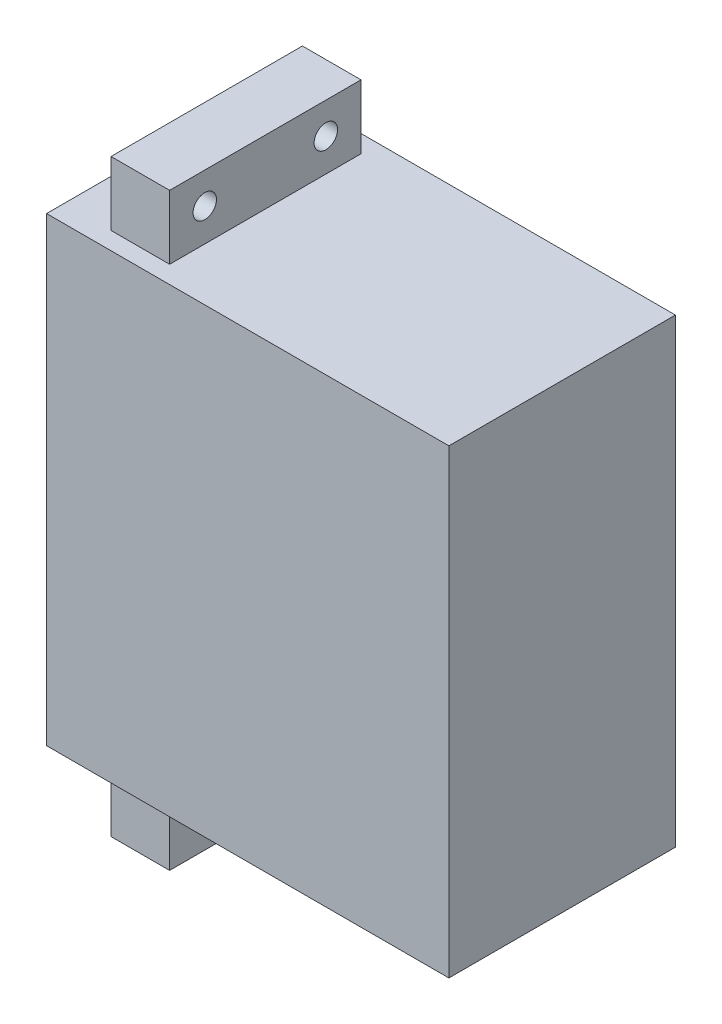
ISO-10303-21;
HEADER;
FILE_DESCRIPTION(('STEP AP214'),'2;1');
FILE_NAME('part.step','',(''),(''),'','','');
FILE_SCHEMA(('AUTOMOTIVE_DESIGN { 1 0 10303 214 1 1 1 1 }'));
ENDSEC;
DATA;
#1=APPLICATION_CONTEXT('core data for automotive mechanical design processes');
#2=APPLICATION_PROTOCOL_DEFINITION('international standard','automotive_design',2000,#1);
#3=PRODUCT_CONTEXT('',#1,'mechanical');
#4=PRODUCT('Part','Part','',(#3));
#5=PRODUCT_RELATED_PRODUCT_CATEGORY('part','',(#4));
#6=PRODUCT_DEFINITION_FORMATION('','',#4);
#7=PRODUCT_DEFINITION_CONTEXT('part definition',#1,'design');
#8=PRODUCT_DEFINITION('design','',#6,#7);
#9=PRODUCT_DEFINITION_SHAPE('','',#8);
#10=(LENGTH_UNIT() NAMED_UNIT(*) SI_UNIT(.MILLI.,.METRE.));
#11=(NAMED_UNIT(*) PLANE_ANGLE_UNIT() SI_UNIT($,.RADIAN.));
#12=(NAMED_UNIT(*) SI_UNIT($,.STERADIAN.) SOLID_ANGLE_UNIT());
#13=UNCERTAINTY_MEASURE_WITH_UNIT(LENGTH_MEASURE(1.E-05),#10,'distance_accuracy_value','');
#14=(GEOMETRIC_REPRESENTATION_CONTEXT(3) GLOBAL_UNCERTAINTY_ASSIGNED_CONTEXT((#13)) GLOBAL_UNIT_ASSIGNED_CONTEXT((#10,
#11,#12)) REPRESENTATION_CONTEXT('',''));
#15=CARTESIAN_POINT('',(0.,0.,0.));
#16=DIRECTION('',(0.,0.,1.));
#17=DIRECTION('',(1.,0.,0.));
#18=AXIS2_PLACEMENT_3D('',#15,#16,#17);
#19=CARTESIAN_POINT('',(0.,59.,29.));
#20=DIRECTION('',(0.,-1.,0.));
#21=DIRECTION('',(0.,0.,-1.));
#22=AXIS2_PLACEMENT_3D('',#19,#20,#21);
#23=PLANE('',#22);
#24=DIRECTION('',(-1.,0.,0.));
#25=VECTOR('',#24,1.);
#26=CARTESIAN_POINT('',(0.,59.,0.));
#27=LINE('',#26,#25);
#28=CARTESIAN_POINT('',(51.5,59.,0.));
#29=VERTEX_POINT('',#28);
#30=CARTESIAN_POINT('',(0.,59.,0.));
#31=VERTEX_POINT('',#30);
#32=EDGE_CURVE('E241',#29,#31,#27,.T.);
#33=ORIENTED_EDGE('',*,*,#32,.T.);
#34=DIRECTION('',(0.,0.,-1.));
#35=VECTOR('',#34,1.);
#36=CARTESIAN_POINT('',(0.,59.,29.));
#37=LINE('',#36,#35);
#38=CARTESIAN_POINT('',(0.,59.,29.));
#39=VERTEX_POINT('',#38);
#40=EDGE_CURVE('E250',#39,#31,#37,.T.);
#41=ORIENTED_EDGE('',*,*,#40,.F.);
#42=DIRECTION('',(-1.,0.,0.));
#43=VECTOR('',#42,1.);
#44=CARTESIAN_POINT('',(0.,59.,29.));
#45=LINE('',#44,#43);
#46=CARTESIAN_POINT('',(51.5,59.,29.));
#47=VERTEX_POINT('',#46);
#48=EDGE_CURVE('E247',#47,#39,#45,.T.);
#49=ORIENTED_EDGE('',*,*,#48,.F.);
#50=DIRECTION('',(0.,0.,-1.));
#51=VECTOR('',#50,1.);
#52=CARTESIAN_POINT('',(51.5,59.,29.));
#53=LINE('',#52,#51);
#54=EDGE_CURVE('E265',#47,#29,#53,.T.);
#55=ORIENTED_EDGE('',*,*,#54,.T.);
#56=EDGE_LOOP('',(#33,#41,#49,#55));
#57=FACE_BOUND('',#56,.T.);
#58=DIRECTION('',(0.,0.,1.));
#59=VECTOR('',#58,1.);
#60=CARTESIAN_POINT('',(6.,59.,2.25));
#61=LINE('',#60,#59);
#62=CARTESIAN_POINT('',(6.,59.,2.25));
#63=VERTEX_POINT('',#62);
#64=CARTESIAN_POINT('',(6.,59.,26.75));
#65=VERTEX_POINT('',#64);
#66=EDGE_CURVE('E207',#63,#65,#61,.T.);
#67=ORIENTED_EDGE('',*,*,#66,.F.);
#68=DIRECTION('',(-1.,0.,0.));
#69=VECTOR('',#68,1.);
#70=CARTESIAN_POINT('',(6.,59.,2.25));
#71=LINE('',#70,#69);
#72=CARTESIAN_POINT('',(13.5,59.,2.25));
#73=VERTEX_POINT('',#72);
#74=EDGE_CURVE('E197',#73,#63,#71,.T.);
#75=ORIENTED_EDGE('',*,*,#74,.F.);
#76=DIRECTION('',(0.,0.,-1.));
#77=VECTOR('',#76,1.);
#78=CARTESIAN_POINT('',(13.5,59.,2.25));
#79=LINE('',#78,#77);
#80=CARTESIAN_POINT('',(13.5,59.,26.75));
#81=VERTEX_POINT('',#80);
#82=EDGE_CURVE('E214',#81,#73,#79,.T.);
#83=ORIENTED_EDGE('',*,*,#82,.F.);
#84=DIRECTION('',(1.,0.,0.));
#85=VECTOR('',#84,1.);
#86=CARTESIAN_POINT('',(6.,59.,26.75));
#87=LINE('',#86,#85);
#88=EDGE_CURVE('E63',#65,#81,#87,.T.);
#89=ORIENTED_EDGE('',*,*,#88,.F.);
#90=EDGE_LOOP('',(#67,#75,#83,#89));
#91=FACE_BOUND('',#90,.T.);
#92=ADVANCED_FACE('F39',(#57,#91),#23,.F.);
#93=CARTESIAN_POINT('',(0.,0.,29.));
#94=DIRECTION('',(1.,0.,0.));
#95=DIRECTION('',(0.,0.,-1.));
#96=AXIS2_PLACEMENT_3D('',#93,#94,#95);
#97=PLANE('',#96);
#98=CARTESIAN_POINT('',(0.,43.7,14.5));
#99=DIRECTION('',(1.,0.,0.));
#100=DIRECTION('',(0.,0.,-1.));
#101=AXIS2_PLACEMENT_3D('',#98,#99,#100);
#102=CIRCLE('',#101,1.5);
#103=CARTESIAN_POINT('',(0.,43.7,13.));
#104=VERTEX_POINT('',#103);
#105=EDGE_CURVE('E11',#104,#104,#102,.F.);
#106=ORIENTED_EDGE('',*,*,#105,.F.);
#107=EDGE_LOOP('',(#106));
#108=FACE_BOUND('',#107,.T.);
#109=DIRECTION('',(0.,-1.,0.));
#110=VECTOR('',#109,1.);
#111=CARTESIAN_POINT('',(0.,0.,0.));
#112=LINE('',#111,#110);
#113=CARTESIAN_POINT('',(0.,0.,0.));
#114=VERTEX_POINT('',#113);
#115=EDGE_CURVE('E235',#31,#114,#112,.T.);
#116=ORIENTED_EDGE('',*,*,#115,.T.);
#117=DIRECTION('',(0.,0.,-1.));
#118=VECTOR('',#117,1.);
#119=CARTESIAN_POINT('',(0.,0.,29.));
#120=LINE('',#119,#118);
#121=CARTESIAN_POINT('',(0.,0.,29.));
#122=VERTEX_POINT('',#121);
#123=EDGE_CURVE('E48',#122,#114,#120,.T.);
#124=ORIENTED_EDGE('',*,*,#123,.F.);
#125=DIRECTION('',(0.,-1.,0.));
#126=VECTOR('',#125,1.);
#127=CARTESIAN_POINT('',(0.,0.,29.));
#128=LINE('',#127,#126);
#129=EDGE_CURVE('E236',#39,#122,#128,.T.);
#130=ORIENTED_EDGE('',*,*,#129,.F.);
#131=ORIENTED_EDGE('',*,*,#40,.T.);
#132=EDGE_LOOP('',(#116,#124,#130,#131));
#133=FACE_BOUND('',#132,.T.);
#134=ADVANCED_FACE('F41',(#108,#133),#97,.F.);
#135=CARTESIAN_POINT('',(0.,0.,29.));
#136=DIRECTION('',(0.,1.,0.));
#137=DIRECTION('',(0.,0.,1.));
#138=AXIS2_PLACEMENT_3D('',#135,#136,#137);
#139=PLANE('',#138);
#140=DIRECTION('',(-1.,0.,0.));
#141=VECTOR('',#140,1.);
#142=CARTESIAN_POINT('',(6.,0.,2.25));
#143=LINE('',#142,#141);
#144=CARTESIAN_POINT('',(13.5,0.,2.25));
#145=VERTEX_POINT('',#144);
#146=CARTESIAN_POINT('',(6.,0.,2.25));
#147=VERTEX_POINT('',#146);
#148=EDGE_CURVE('E168',#145,#147,#143,.T.);
#149=ORIENTED_EDGE('',*,*,#148,.T.);
#150=DIRECTION('',(0.,0.,1.));
#151=VECTOR('',#150,1.);
#152=CARTESIAN_POINT('',(6.,0.,2.25));
#153=LINE('',#152,#151);
#154=CARTESIAN_POINT('',(6.,0.,26.75));
#155=VERTEX_POINT('',#154);
#156=EDGE_CURVE('E135',#147,#155,#153,.T.);
#157=ORIENTED_EDGE('',*,*,#156,.T.);
#158=DIRECTION('',(1.,0.,0.));
#159=VECTOR('',#158,1.);
#160=CARTESIAN_POINT('',(6.,0.,26.75));
#161=LINE('',#160,#159);
#162=CARTESIAN_POINT('',(13.5,0.,26.75));
#163=VERTEX_POINT('',#162);
#164=EDGE_CURVE('E153',#155,#163,#161,.T.);
#165=ORIENTED_EDGE('',*,*,#164,.T.);
#166=DIRECTION('',(0.,0.,-1.));
#167=VECTOR('',#166,1.);
#168=CARTESIAN_POINT('',(13.5,0.,2.25));
#169=LINE('',#168,#167);
#170=EDGE_CURVE('E55',#163,#145,#169,.T.);
#171=ORIENTED_EDGE('',*,*,#170,.T.);
#172=EDGE_LOOP('',(#149,#157,#165,#171));
#173=FACE_BOUND('',#172,.T.);
#174=DIRECTION('',(1.,0.,0.));
#175=VECTOR('',#174,1.);
#176=CARTESIAN_POINT('',(0.,0.,0.));
#177=LINE('',#176,#175);
#178=CARTESIAN_POINT('',(51.5,0.,0.));
#179=VERTEX_POINT('',#178);
#180=EDGE_CURVE('E254',#114,#179,#177,.T.);
#181=ORIENTED_EDGE('',*,*,#180,.T.);
#182=DIRECTION('',(0.,0.,-1.));
#183=VECTOR('',#182,1.);
#184=CARTESIAN_POINT('',(51.5,0.,29.));
#185=LINE('',#184,#183);
#186=CARTESIAN_POINT('',(51.5,0.,29.));
#187=VERTEX_POINT('',#186);
#188=EDGE_CURVE('E269',#187,#179,#185,.T.);
#189=ORIENTED_EDGE('',*,*,#188,.F.);
#190=DIRECTION('',(1.,0.,0.));
#191=VECTOR('',#190,1.);
#192=CARTESIAN_POINT('',(0.,0.,29.));
#193=LINE('',#192,#191);
#194=EDGE_CURVE('E240',#122,#187,#193,.T.);
#195=ORIENTED_EDGE('',*,*,#194,.F.);
#196=ORIENTED_EDGE('',*,*,#123,.T.);
#197=EDGE_LOOP('',(#181,#189,#195,#196));
#198=FACE_BOUND('',#197,.T.);
#199=ADVANCED_FACE('F322',(#173,#198),#139,.F.);
#200=CARTESIAN_POINT('',(51.5,0.,29.));
#201=DIRECTION('',(-1.,0.,0.));
#202=DIRECTION('',(0.,0.,1.));
#203=AXIS2_PLACEMENT_3D('',#200,#201,#202);
#204=PLANE('',#203);
#205=DIRECTION('',(0.,1.,0.));
#206=VECTOR('',#205,1.);
#207=CARTESIAN_POINT('',(51.5,0.,0.));
#208=LINE('',#207,#206);
#209=EDGE_CURVE('E257',#179,#29,#208,.T.);
#210=ORIENTED_EDGE('',*,*,#209,.T.);
#211=ORIENTED_EDGE('',*,*,#54,.F.);
#212=DIRECTION('',(0.,1.,0.));
#213=VECTOR('',#212,1.);
#214=CARTESIAN_POINT('',(51.5,0.,29.));
#215=LINE('',#214,#213);
#216=EDGE_CURVE('E244',#187,#47,#215,.T.);
#217=ORIENTED_EDGE('',*,*,#216,.F.);
#218=ORIENTED_EDGE('',*,*,#188,.T.);
#219=EDGE_LOOP('',(#210,#211,#217,#218));
#220=FACE_BOUND('',#219,.T.);
#221=ADVANCED_FACE('F340',(#220),#204,.F.);
#222=CARTESIAN_POINT('',(0.,0.,29.));
#223=DIRECTION('',(0.,0.,-1.));
#224=DIRECTION('',(-1.,0.,0.));
#225=AXIS2_PLACEMENT_3D('',#222,#223,#224);
#226=PLANE('',#225);
#227=ORIENTED_EDGE('',*,*,#129,.T.);
#228=ORIENTED_EDGE('',*,*,#194,.T.);
#229=ORIENTED_EDGE('',*,*,#216,.T.);
#230=ORIENTED_EDGE('',*,*,#48,.T.);
#231=EDGE_LOOP('',(#227,#228,#229,#230));
#232=FACE_BOUND('',#231,.T.);
#233=ADVANCED_FACE('F335',(#232),#226,.F.);
#234=CARTESIAN_POINT('',(0.,0.,0.));
#235=DIRECTION('',(0.,0.,-1.));
#236=DIRECTION('',(-1.,0.,0.));
#237=AXIS2_PLACEMENT_3D('',#234,#235,#236);
#238=PLANE('',#237);
#239=ORIENTED_EDGE('',*,*,#115,.F.);
#240=ORIENTED_EDGE('',*,*,#32,.F.);
#241=ORIENTED_EDGE('',*,*,#209,.F.);
#242=ORIENTED_EDGE('',*,*,#180,.F.);
#243=EDGE_LOOP('',(#239,#240,#241,#242));
#244=FACE_BOUND('',#243,.T.);
#245=ADVANCED_FACE('F329',(#244),#238,.T.);
#246=CARTESIAN_POINT('',(6.,67.2,2.25));
#247=DIRECTION('',(1.,0.,0.));
#248=DIRECTION('',(0.,0.,-1.));
#249=AXIS2_PLACEMENT_3D('',#246,#247,#248);
#250=PLANE('',#249);
#251=CARTESIAN_POINT('',(6.,63.2,6.75));
#252=DIRECTION('',(-1.,0.,0.));
#253=DIRECTION('',(0.,0.,1.));
#254=AXIS2_PLACEMENT_3D('',#251,#252,#253);
#255=CIRCLE('',#254,1.5);
#256=CARTESIAN_POINT('',(6.,63.2,8.25));
#257=VERTEX_POINT('',#256);
#258=EDGE_CURVE('E184',#257,#257,#255,.T.);
#259=ORIENTED_EDGE('',*,*,#258,.F.);
#260=EDGE_LOOP('',(#259));
#261=FACE_BOUND('',#260,.T.);
#262=CARTESIAN_POINT('',(6.,63.2,22.25));
#263=DIRECTION('',(-1.,0.,0.));
#264=DIRECTION('',(0.,0.,-1.));
#265=AXIS2_PLACEMENT_3D('',#262,#263,#264);
#266=CIRCLE('',#265,1.5);
#267=CARTESIAN_POINT('',(6.,63.2,20.75));
#268=VERTEX_POINT('',#267);
#269=EDGE_CURVE('E141',#268,#268,#266,.T.);
#270=ORIENTED_EDGE('',*,*,#269,.F.);
#271=EDGE_LOOP('',(#270));
#272=FACE_BOUND('',#271,.T.);
#273=ORIENTED_EDGE('',*,*,#66,.T.);
#274=DIRECTION('',(0.,-1.,0.));
#275=VECTOR('',#274,1.);
#276=CARTESIAN_POINT('',(6.,67.2,26.75));
#277=LINE('',#276,#275);
#278=CARTESIAN_POINT('',(6.,67.2,26.75));
#279=VERTEX_POINT('',#278);
#280=EDGE_CURVE('E232',#279,#65,#277,.T.);
#281=ORIENTED_EDGE('',*,*,#280,.F.);
#282=DIRECTION('',(0.,0.,1.));
#283=VECTOR('',#282,1.);
#284=CARTESIAN_POINT('',(6.,67.2,2.25));
#285=LINE('',#284,#283);
#286=CARTESIAN_POINT('',(6.,67.2,2.25));
#287=VERTEX_POINT('',#286);
#288=EDGE_CURVE('E192',#287,#279,#285,.T.);
#289=ORIENTED_EDGE('',*,*,#288,.F.);
#290=DIRECTION('',(0.,-1.,0.));
#291=VECTOR('',#290,1.);
#292=CARTESIAN_POINT('',(6.,67.2,2.25));
#293=LINE('',#292,#291);
#294=EDGE_CURVE('E206',#287,#63,#293,.T.);
#295=ORIENTED_EDGE('',*,*,#294,.T.);
#296=EDGE_LOOP('',(#273,#281,#289,#295));
#297=FACE_BOUND('',#296,.T.);
#298=ADVANCED_FACE('F355',(#261,#272,#297),#250,.F.);
#299=CARTESIAN_POINT('',(6.,67.2,26.75));
#300=DIRECTION('',(0.,0.,-1.));
#301=DIRECTION('',(-1.,0.,0.));
#302=AXIS2_PLACEMENT_3D('',#299,#300,#301);
#303=PLANE('',#302);
#304=ORIENTED_EDGE('',*,*,#88,.T.);
#305=DIRECTION('',(0.,-1.,0.));
#306=VECTOR('',#305,1.);
#307=CARTESIAN_POINT('',(13.5,67.2,26.75));
#308=LINE('',#307,#306);
#309=CARTESIAN_POINT('',(13.5,67.2,26.75));
#310=VERTEX_POINT('',#309);
#311=EDGE_CURVE('E228',#310,#81,#308,.T.);
#312=ORIENTED_EDGE('',*,*,#311,.F.);
#313=DIRECTION('',(1.,0.,0.));
#314=VECTOR('',#313,1.);
#315=CARTESIAN_POINT('',(6.,67.2,26.75));
#316=LINE('',#315,#314);
#317=EDGE_CURVE('E196',#279,#310,#316,.T.);
#318=ORIENTED_EDGE('',*,*,#317,.F.);
#319=ORIENTED_EDGE('',*,*,#280,.T.);
#320=EDGE_LOOP('',(#304,#312,#318,#319));
#321=FACE_BOUND('',#320,.T.);
#322=ADVANCED_FACE('F359',(#321),#303,.F.);
#323=CARTESIAN_POINT('',(13.5,67.2,2.25));
#324=DIRECTION('',(-1.,0.,0.));
#325=DIRECTION('',(0.,0.,1.));
#326=AXIS2_PLACEMENT_3D('',#323,#324,#325);
#327=PLANE('',#326);
#328=CARTESIAN_POINT('',(13.5,63.2,6.75));
#329=DIRECTION('',(-1.,0.,0.));
#330=DIRECTION('',(0.,0.,1.));
#331=AXIS2_PLACEMENT_3D('',#328,#329,#330);
#332=CIRCLE('',#331,1.5);
#333=CARTESIAN_POINT('',(13.5,63.2,8.25));
#334=VERTEX_POINT('',#333);
#335=EDGE_CURVE('E211',#334,#334,#332,.T.);
#336=ORIENTED_EDGE('',*,*,#335,.T.);
#337=EDGE_LOOP('',(#336));
#338=FACE_BOUND('',#337,.T.);
#339=CARTESIAN_POINT('',(13.5,63.2,22.25));
#340=DIRECTION('',(-1.,0.,0.));
#341=DIRECTION('',(0.,0.,1.));
#342=AXIS2_PLACEMENT_3D('',#339,#340,#341);
#343=CIRCLE('',#342,1.5);
#344=CARTESIAN_POINT('',(13.5,63.2,23.75));
#345=VERTEX_POINT('',#344);
#346=EDGE_CURVE('E188',#345,#345,#343,.T.);
#347=ORIENTED_EDGE('',*,*,#346,.T.);
#348=EDGE_LOOP('',(#347));
#349=FACE_BOUND('',#348,.T.);
#350=ORIENTED_EDGE('',*,*,#82,.T.);
#351=DIRECTION('',(0.,-1.,0.));
#352=VECTOR('',#351,1.);
#353=CARTESIAN_POINT('',(13.5,67.2,2.25));
#354=LINE('',#353,#352);
#355=CARTESIAN_POINT('',(13.5,67.2,2.25));
#356=VERTEX_POINT('',#355);
#357=EDGE_CURVE('E224',#356,#73,#354,.T.);
#358=ORIENTED_EDGE('',*,*,#357,.F.);
#359=DIRECTION('',(0.,0.,-1.));
#360=VECTOR('',#359,1.);
#361=CARTESIAN_POINT('',(13.5,67.2,2.25));
#362=LINE('',#361,#360);
#363=EDGE_CURVE('E200',#310,#356,#362,.T.);
#364=ORIENTED_EDGE('',*,*,#363,.F.);
#365=ORIENTED_EDGE('',*,*,#311,.T.);
#366=EDGE_LOOP('',(#350,#358,#364,#365));
#367=FACE_BOUND('',#366,.T.);
#368=ADVANCED_FACE('F363',(#338,#349,#367),#327,.F.);
#369=CARTESIAN_POINT('',(6.,67.2,2.25));
#370=DIRECTION('',(0.,0.,1.));
#371=DIRECTION('',(1.,0.,0.));
#372=AXIS2_PLACEMENT_3D('',#369,#370,#371);
#373=PLANE('',#372);
#374=ORIENTED_EDGE('',*,*,#74,.T.);
#375=ORIENTED_EDGE('',*,*,#294,.F.);
#376=DIRECTION('',(-1.,0.,0.));
#377=VECTOR('',#376,1.);
#378=CARTESIAN_POINT('',(6.,67.2,2.25));
#379=LINE('',#378,#377);
#380=EDGE_CURVE('E203',#356,#287,#379,.T.);
#381=ORIENTED_EDGE('',*,*,#380,.F.);
#382=ORIENTED_EDGE('',*,*,#357,.T.);
#383=EDGE_LOOP('',(#374,#375,#381,#382));
#384=FACE_BOUND('',#383,.T.);
#385=ADVANCED_FACE('F367',(#384),#373,.F.);
#386=CARTESIAN_POINT('',(0.,67.2,0.));
#387=DIRECTION('',(0.,1.,0.));
#388=DIRECTION('',(0.,0.,1.));
#389=AXIS2_PLACEMENT_3D('',#386,#387,#388);
#390=PLANE('',#389);
#391=ORIENTED_EDGE('',*,*,#288,.T.);
#392=ORIENTED_EDGE('',*,*,#317,.T.);
#393=ORIENTED_EDGE('',*,*,#363,.T.);
#394=ORIENTED_EDGE('',*,*,#380,.T.);
#395=EDGE_LOOP('',(#391,#392,#393,#394));
#396=FACE_BOUND('',#395,.T.);
#397=ADVANCED_FACE('F371',(#396),#390,.T.);
#398=CARTESIAN_POINT('',(14.2,63.2,22.25));
#399=DIRECTION('',(-1.,0.,0.));
#400=DIRECTION('',(0.,0.,1.));
#401=AXIS2_PLACEMENT_3D('',#398,#399,#400);
#402=CYLINDRICAL_SURFACE('',#401,1.5);
#403=ORIENTED_EDGE('',*,*,#269,.T.);
#404=EDGE_LOOP('',(#403));
#405=FACE_BOUND('',#404,.T.);
#406=ORIENTED_EDGE('',*,*,#346,.F.);
#407=EDGE_LOOP('',(#406));
#408=FACE_BOUND('',#407,.T.);
#409=ADVANCED_FACE('F375',(#405,#408),#402,.F.);
#410=CARTESIAN_POINT('',(14.2,63.2,6.75));
#411=DIRECTION('',(-1.,0.,0.));
#412=DIRECTION('',(0.,0.,1.));
#413=AXIS2_PLACEMENT_3D('',#410,#411,#412);
#414=CYLINDRICAL_SURFACE('',#413,1.5);
#415=ORIENTED_EDGE('',*,*,#258,.T.);
#416=EDGE_LOOP('',(#415));
#417=FACE_BOUND('',#416,.T.);
#418=ORIENTED_EDGE('',*,*,#335,.F.);
#419=EDGE_LOOP('',(#418));
#420=FACE_BOUND('',#419,.T.);
#421=ADVANCED_FACE('F379',(#417,#420),#414,.F.);
#422=CARTESIAN_POINT('',(6.,-8.2,2.25));
#423=DIRECTION('',(-1.,0.,0.));
#424=DIRECTION('',(0.,0.,1.));
#425=AXIS2_PLACEMENT_3D('',#422,#423,#424);
#426=PLANE('',#425);
#427=CARTESIAN_POINT('',(6.,-4.2,6.75));
#428=DIRECTION('',(1.,0.,0.));
#429=DIRECTION('',(0.,0.,1.));
#430=AXIS2_PLACEMENT_3D('',#427,#428,#429);
#431=CIRCLE('',#430,1.5);
#432=CARTESIAN_POINT('',(6.,-4.2,8.25));
#433=VERTEX_POINT('',#432);
#434=EDGE_CURVE('E285',#433,#433,#431,.T.);
#435=ORIENTED_EDGE('',*,*,#434,.T.);
#436=EDGE_LOOP('',(#435));
#437=FACE_BOUND('',#436,.T.);
#438=CARTESIAN_POINT('',(6.,-4.2,22.25));
#439=DIRECTION('',(1.,0.,0.));
#440=DIRECTION('',(0.,0.,-1.));
#441=AXIS2_PLACEMENT_3D('',#438,#439,#440);
#442=CIRCLE('',#441,1.5);
#443=CARTESIAN_POINT('',(6.,-4.2,20.75));
#444=VERTEX_POINT('',#443);
#445=EDGE_CURVE('E303',#444,#444,#442,.T.);
#446=ORIENTED_EDGE('',*,*,#445,.T.);
#447=EDGE_LOOP('',(#446));
#448=FACE_BOUND('',#447,.T.);
#449=ORIENTED_EDGE('',*,*,#156,.F.);
#450=DIRECTION('',(0.,1.,0.));
#451=VECTOR('',#450,1.);
#452=CARTESIAN_POINT('',(6.,-8.2,2.25));
#453=LINE('',#452,#451);
#454=CARTESIAN_POINT('',(6.,-8.2,2.25));
#455=VERTEX_POINT('',#454);
#456=EDGE_CURVE('E129',#455,#147,#453,.T.);
#457=ORIENTED_EDGE('',*,*,#456,.F.);
#458=DIRECTION('',(0.,0.,1.));
#459=VECTOR('',#458,1.);
#460=CARTESIAN_POINT('',(6.,-8.2,2.25));
#461=LINE('',#460,#459);
#462=CARTESIAN_POINT('',(6.,-8.2,26.75));
#463=VERTEX_POINT('',#462);
#464=EDGE_CURVE('E132',#455,#463,#461,.T.);
#465=ORIENTED_EDGE('',*,*,#464,.T.);
#466=DIRECTION('',(0.,1.,0.));
#467=VECTOR('',#466,1.);
#468=CARTESIAN_POINT('',(6.,-8.2,26.75));
#469=LINE('',#468,#467);
#470=EDGE_CURVE('E165',#463,#155,#469,.T.);
#471=ORIENTED_EDGE('',*,*,#470,.T.);
#472=EDGE_LOOP('',(#449,#457,#465,#471));
#473=FACE_BOUND('',#472,.T.);
#474=ADVANCED_FACE('F131',(#437,#448,#473),#426,.T.);
#475=CARTESIAN_POINT('',(6.,-8.2,2.25));
#476=DIRECTION('',(0.,0.,-1.));
#477=DIRECTION('',(-1.,0.,0.));
#478=AXIS2_PLACEMENT_3D('',#475,#476,#477);
#479=PLANE('',#478);
#480=ORIENTED_EDGE('',*,*,#148,.F.);
#481=DIRECTION('',(0.,1.,0.));
#482=VECTOR('',#481,1.);
#483=CARTESIAN_POINT('',(13.5,-8.2,2.25));
#484=LINE('',#483,#482);
#485=CARTESIAN_POINT('',(13.5,-8.2,2.25));
#486=VERTEX_POINT('',#485);
#487=EDGE_CURVE('E142',#486,#145,#484,.T.);
#488=ORIENTED_EDGE('',*,*,#487,.F.);
#489=DIRECTION('',(-1.,0.,0.));
#490=VECTOR('',#489,1.);
#491=CARTESIAN_POINT('',(6.,-8.2,2.25));
#492=LINE('',#491,#490);
#493=EDGE_CURVE('E148',#486,#455,#492,.T.);
#494=ORIENTED_EDGE('',*,*,#493,.T.);
#495=ORIENTED_EDGE('',*,*,#456,.T.);
#496=EDGE_LOOP('',(#480,#488,#494,#495));
#497=FACE_BOUND('',#496,.T.);
#498=ADVANCED_FACE('F155',(#497),#479,.T.);
#499=CARTESIAN_POINT('',(13.5,-8.2,2.25));
#500=DIRECTION('',(1.,0.,0.));
#501=DIRECTION('',(0.,0.,-1.));
#502=AXIS2_PLACEMENT_3D('',#499,#500,#501);
#503=PLANE('',#502);
#504=CARTESIAN_POINT('',(13.5,-4.2,6.75));
#505=DIRECTION('',(1.,0.,0.));
#506=DIRECTION('',(0.,0.,-1.));
#507=AXIS2_PLACEMENT_3D('',#504,#505,#506);
#508=CIRCLE('',#507,1.5);
#509=CARTESIAN_POINT('',(13.5,-4.2,5.25));
#510=VERTEX_POINT('',#509);
#511=EDGE_CURVE('E169',#510,#510,#508,.F.);
#512=ORIENTED_EDGE('',*,*,#511,.T.);
#513=EDGE_LOOP('',(#512));
#514=FACE_BOUND('',#513,.T.);
#515=CARTESIAN_POINT('',(13.5,-4.2,22.25));
#516=DIRECTION('',(1.,0.,0.));
#517=DIRECTION('',(0.,0.,-1.));
#518=AXIS2_PLACEMENT_3D('',#515,#516,#517);
#519=CIRCLE('',#518,1.5);
#520=CARTESIAN_POINT('',(13.5,-4.2,20.75));
#521=VERTEX_POINT('',#520);
#522=EDGE_CURVE('E282',#521,#521,#519,.F.);
#523=ORIENTED_EDGE('',*,*,#522,.T.);
#524=EDGE_LOOP('',(#523));
#525=FACE_BOUND('',#524,.T.);
#526=ORIENTED_EDGE('',*,*,#170,.F.);
#527=DIRECTION('',(0.,1.,0.));
#528=VECTOR('',#527,1.);
#529=CARTESIAN_POINT('',(13.5,-8.2,26.75));
#530=LINE('',#529,#528);
#531=CARTESIAN_POINT('',(13.5,-8.2,26.75));
#532=VERTEX_POINT('',#531);
#533=EDGE_CURVE('E179',#532,#163,#530,.T.);
#534=ORIENTED_EDGE('',*,*,#533,.F.);
#535=DIRECTION('',(0.,0.,-1.));
#536=VECTOR('',#535,1.);
#537=CARTESIAN_POINT('',(13.5,-8.2,2.25));
#538=LINE('',#537,#536);
#539=EDGE_CURVE('E157',#532,#486,#538,.T.);
#540=ORIENTED_EDGE('',*,*,#539,.T.);
#541=ORIENTED_EDGE('',*,*,#487,.T.);
#542=EDGE_LOOP('',(#526,#534,#540,#541));
#543=FACE_BOUND('',#542,.T.);
#544=ADVANCED_FACE('F290',(#514,#525,#543),#503,.T.);
#545=CARTESIAN_POINT('',(6.,-8.2,26.75));
#546=DIRECTION('',(0.,0.,1.));
#547=DIRECTION('',(1.,0.,0.));
#548=AXIS2_PLACEMENT_3D('',#545,#546,#547);
#549=PLANE('',#548);
#550=ORIENTED_EDGE('',*,*,#164,.F.);
#551=ORIENTED_EDGE('',*,*,#470,.F.);
#552=DIRECTION('',(1.,0.,0.));
#553=VECTOR('',#552,1.);
#554=CARTESIAN_POINT('',(6.,-8.2,26.75));
#555=LINE('',#554,#553);
#556=EDGE_CURVE('E151',#463,#532,#555,.T.);
#557=ORIENTED_EDGE('',*,*,#556,.T.);
#558=ORIENTED_EDGE('',*,*,#533,.T.);
#559=EDGE_LOOP('',(#550,#551,#557,#558));
#560=FACE_BOUND('',#559,.T.);
#561=ADVANCED_FACE('F390',(#560),#549,.T.);
#562=CARTESIAN_POINT('',(0.,-8.2,0.));
#563=DIRECTION('',(0.,-1.,0.));
#564=DIRECTION('',(0.,0.,1.));
#565=AXIS2_PLACEMENT_3D('',#562,#563,#564);
#566=PLANE('',#565);
#567=ORIENTED_EDGE('',*,*,#464,.F.);
#568=ORIENTED_EDGE('',*,*,#493,.F.);
#569=ORIENTED_EDGE('',*,*,#539,.F.);
#570=ORIENTED_EDGE('',*,*,#556,.F.);
#571=EDGE_LOOP('',(#567,#568,#569,#570));
#572=FACE_BOUND('',#571,.T.);
#573=ADVANCED_FACE('F146',(#572),#566,.T.);
#574=CARTESIAN_POINT('',(14.2,-4.2,22.25));
#575=DIRECTION('',(-1.,0.,0.));
#576=DIRECTION('',(0.,0.,1.));
#577=AXIS2_PLACEMENT_3D('',#574,#575,#576);
#578=CYLINDRICAL_SURFACE('',#577,1.5);
#579=ORIENTED_EDGE('',*,*,#522,.F.);
#580=EDGE_LOOP('',(#579));
#581=FACE_BOUND('',#580,.T.);
#582=ORIENTED_EDGE('',*,*,#445,.F.);
#583=EDGE_LOOP('',(#582));
#584=FACE_BOUND('',#583,.T.);
#585=ADVANCED_FACE('F297',(#581,#584),#578,.F.);
#586=CARTESIAN_POINT('',(14.2,-4.2,6.75));
#587=DIRECTION('',(-1.,0.,0.));
#588=DIRECTION('',(0.,0.,1.));
#589=AXIS2_PLACEMENT_3D('',#586,#587,#588);
#590=CYLINDRICAL_SURFACE('',#589,1.5);
#591=ORIENTED_EDGE('',*,*,#511,.F.);
#592=EDGE_LOOP('',(#591));
#593=FACE_BOUND('',#592,.T.);
#594=ORIENTED_EDGE('',*,*,#434,.F.);
#595=EDGE_LOOP('',(#594));
#596=FACE_BOUND('',#595,.T.);
#597=ADVANCED_FACE('F293',(#593,#596),#590,.F.);
#598=CARTESIAN_POINT('',(-2.,43.7,14.5));
#599=DIRECTION('',(1.,0.,0.));
#600=DIRECTION('',(0.,0.,-1.));
#601=AXIS2_PLACEMENT_3D('',#598,#599,#600);
#602=CYLINDRICAL_SURFACE('',#601,1.5);
#603=CARTESIAN_POINT('',(-2.,43.7,14.5));
#604=DIRECTION('',(-1.,0.,0.));
#605=DIRECTION('',(0.,0.,1.));
#606=AXIS2_PLACEMENT_3D('',#603,#604,#605);
#607=CIRCLE('',#606,1.5);
#608=CARTESIAN_POINT('',(-2.,43.7,16.));
#609=VERTEX_POINT('',#608);
#610=EDGE_CURVE('E307',#609,#609,#607,.T.);
#611=ORIENTED_EDGE('',*,*,#610,.F.);
#612=EDGE_LOOP('',(#611));
#613=FACE_BOUND('',#612,.T.);
#614=ORIENTED_EDGE('',*,*,#105,.T.);
#615=EDGE_LOOP('',(#614));
#616=FACE_BOUND('',#615,.T.);
#617=ADVANCED_FACE('F296',(#613,#616),#602,.T.);
#618=CARTESIAN_POINT('',(-2.,43.7,14.5));
#619=DIRECTION('',(-1.,0.,0.));
#620=DIRECTION('',(0.,0.,1.));
#621=AXIS2_PLACEMENT_3D('',#618,#619,#620);
#622=PLANE('',#621);
#623=ORIENTED_EDGE('',*,*,#610,.T.);
#624=EDGE_LOOP('',(#623));
#625=FACE_BOUND('',#624,.T.);
#626=ADVANCED_FACE('F313',(#625),#622,.T.);
#627=CLOSED_SHELL('',(#92,#134,#199,#221,#233,#245,#298,#322,#368,#385,#397,#409,#421,#474,#498,
#544,#561,#573,#585,#597,#617,#626));
#628=MANIFOLD_SOLID_BREP('B2',#627);
#629=ADVANCED_BREP_SHAPE_REPRESENTATION('',(#18,#628),#14);
#630=SHAPE_DEFINITION_REPRESENTATION(#9,#629);
ENDSEC;
END-ISO-10303-21;
